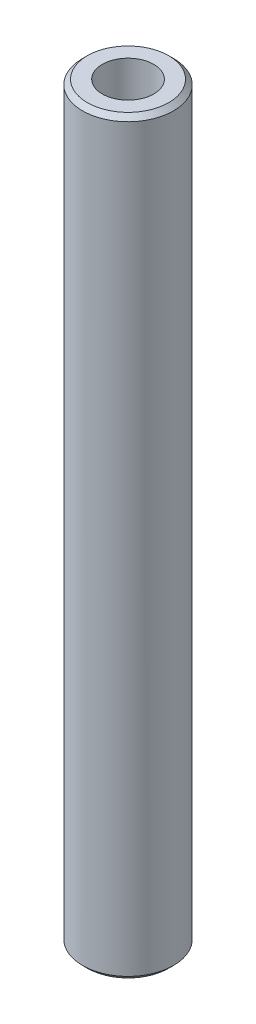
ISO-10303-21;
HEADER;
FILE_DESCRIPTION(('STEP AP214'),'2;1');
FILE_NAME('part.step','',(''),(''),'','','');
FILE_SCHEMA(('AUTOMOTIVE_DESIGN { 1 0 10303 214 1 1 1 1 }'));
ENDSEC;
DATA;
#1=APPLICATION_CONTEXT('core data for automotive mechanical design processes');
#2=APPLICATION_PROTOCOL_DEFINITION('international standard','automotive_design',2000,#1);
#3=PRODUCT_CONTEXT('',#1,'mechanical');
#4=PRODUCT('Part','Part','',(#3));
#5=PRODUCT_RELATED_PRODUCT_CATEGORY('part','',(#4));
#6=PRODUCT_DEFINITION_FORMATION('','',#4);
#7=PRODUCT_DEFINITION_CONTEXT('part definition',#1,'design');
#8=PRODUCT_DEFINITION('design','',#6,#7);
#9=PRODUCT_DEFINITION_SHAPE('','',#8);
#10=(LENGTH_UNIT() NAMED_UNIT(*) SI_UNIT(.MILLI.,.METRE.));
#11=(NAMED_UNIT(*) PLANE_ANGLE_UNIT() SI_UNIT($,.RADIAN.));
#12=(NAMED_UNIT(*) SI_UNIT($,.STERADIAN.) SOLID_ANGLE_UNIT());
#13=UNCERTAINTY_MEASURE_WITH_UNIT(LENGTH_MEASURE(1.E-05),#10,'distance_accuracy_value','');
#14=(GEOMETRIC_REPRESENTATION_CONTEXT(3) GLOBAL_UNCERTAINTY_ASSIGNED_CONTEXT((#13)) GLOBAL_UNIT_ASSIGNED_CONTEXT((#10,
#11,#12)) REPRESENTATION_CONTEXT('',''));
#15=CARTESIAN_POINT('',(0.,0.,0.));
#16=DIRECTION('',(0.,0.,1.));
#17=DIRECTION('',(1.,0.,0.));
#18=AXIS2_PLACEMENT_3D('',#15,#16,#17);
#19=CARTESIAN_POINT('',(0.,494.819400580085,0.));
#20=DIRECTION('',(0.,-1.,0.));
#21=DIRECTION('',(0.,0.,-1.));
#22=AXIS2_PLACEMENT_3D('',#19,#20,#21);
#23=CYLINDRICAL_SURFACE('',#22,30.);
#24=CARTESIAN_POINT('',(0.,491.671943410015,0.));
#25=DIRECTION('',(0.,1.,0.));
#26=DIRECTION('',(0.,0.,1.));
#27=AXIS2_PLACEMENT_3D('',#24,#25,#26);
#28=CIRCLE('',#27,30.);
#29=CARTESIAN_POINT('',(0.,491.671943410015,-30.));
#30=VERTEX_POINT('',#29);
#31=EDGE_CURVE('E50',#30,#30,#28,.F.);
#32=CARTESIAN_POINT('',(0.,3.14745717007053,0.));
#33=DIRECTION('',(0.,1.,0.));
#34=DIRECTION('',(0.,0.,1.));
#35=AXIS2_PLACEMENT_3D('',#32,#33,#34);
#36=CIRCLE('',#35,30.);
#37=CARTESIAN_POINT('',(0.,3.14745717007053,-30.));
#38=VERTEX_POINT('',#37);
#39=EDGE_CURVE('E51',#38,#38,#36,.T.);
#40=CARTESIAN_POINT('',(0.,491.671943410015,-30.));
#41=CARTESIAN_POINT('',(0.,486.583146678349,-30.));
#42=CARTESIAN_POINT('',(0.,481.494349946683,-30.));
#43=CARTESIAN_POINT('',(0.,471.31675648335,-30.));
#44=CARTESIAN_POINT('',(0.,466.227959751684,-30.));
#45=CARTESIAN_POINT('',(0.,456.050366288352,-30.));
#46=CARTESIAN_POINT('',(0.,450.961569556686,-30.));
#47=CARTESIAN_POINT('',(0.,440.783976093354,-30.));
#48=CARTESIAN_POINT('',(0.,435.695179361688,-30.));
#49=CARTESIAN_POINT('',(0.,425.517585898356,-30.));
#50=CARTESIAN_POINT('',(0.,420.42878916669,-30.));
#51=CARTESIAN_POINT('',(0.,410.251195703357,-30.));
#52=CARTESIAN_POINT('',(0.,405.162398971691,-30.));
#53=CARTESIAN_POINT('',(0.,394.984805508359,-30.));
#54=CARTESIAN_POINT('',(0.,389.896008776693,-30.));
#55=CARTESIAN_POINT('',(0.,379.718415313361,-30.));
#56=CARTESIAN_POINT('',(0.,374.629618581695,-30.));
#57=CARTESIAN_POINT('',(0.,364.452025118363,-30.));
#58=CARTESIAN_POINT('',(0.,359.363228386697,-30.));
#59=CARTESIAN_POINT('',(0.,349.185634923364,-30.));
#60=CARTESIAN_POINT('',(0.,344.096838191698,-30.));
#61=CARTESIAN_POINT('',(0.,333.919244728366,-30.));
#62=CARTESIAN_POINT('',(0.,328.8304479967,-30.));
#63=CARTESIAN_POINT('',(0.,318.652854533368,-30.));
#64=CARTESIAN_POINT('',(0.,313.564057801702,-30.));
#65=CARTESIAN_POINT('',(0.,303.38646433837,-30.));
#66=CARTESIAN_POINT('',(0.,298.297667606704,-30.));
#67=CARTESIAN_POINT('',(0.,288.120074143371,-30.));
#68=CARTESIAN_POINT('',(0.,283.031277411705,-30.));
#69=CARTESIAN_POINT('',(0.,272.853683948373,-30.));
#70=CARTESIAN_POINT('',(0.,267.764887216707,-30.));
#71=CARTESIAN_POINT('',(0.,257.587293753375,-30.));
#72=CARTESIAN_POINT('',(0.,252.498497021709,-30.));
#73=CARTESIAN_POINT('',(0.,242.320903558377,-30.));
#74=CARTESIAN_POINT('',(0.,237.23210682671,-30.));
#75=CARTESIAN_POINT('',(0.,227.054513363378,-30.));
#76=CARTESIAN_POINT('',(0.,221.965716631712,-30.));
#77=CARTESIAN_POINT('',(0.,211.78812316838,-30.));
#78=CARTESIAN_POINT('',(0.,206.699326436714,-30.));
#79=CARTESIAN_POINT('',(0.,196.521732973382,-30.));
#80=CARTESIAN_POINT('',(0.,191.432936241716,-30.));
#81=CARTESIAN_POINT('',(0.,181.255342778384,-30.));
#82=CARTESIAN_POINT('',(0.,176.166546046717,-30.));
#83=CARTESIAN_POINT('',(0.,165.988952583385,-30.));
#84=CARTESIAN_POINT('',(0.,160.900155851719,-30.));
#85=CARTESIAN_POINT('',(0.,150.722562388387,-30.));
#86=CARTESIAN_POINT('',(0.,145.633765656721,-30.));
#87=CARTESIAN_POINT('',(0.,135.456172193389,-30.));
#88=CARTESIAN_POINT('',(0.,130.367375461723,-30.));
#89=CARTESIAN_POINT('',(0.,120.189781998391,-30.));
#90=CARTESIAN_POINT('',(0.,115.100985266724,-30.));
#91=CARTESIAN_POINT('',(0.,104.923391803392,-30.));
#92=CARTESIAN_POINT('',(0.,99.8345950717262,-30.));
#93=CARTESIAN_POINT('',(0.,89.657001608394,-30.));
#94=CARTESIAN_POINT('',(0.,84.5682048767279,-30.));
#95=CARTESIAN_POINT('',(0.,74.3906114133957,-30.));
#96=CARTESIAN_POINT('',(0.,69.3018146817297,-30.));
#97=CARTESIAN_POINT('',(0.,59.1242212183975,-30.));
#98=CARTESIAN_POINT('',(0.,54.0354244867314,-30.));
#99=CARTESIAN_POINT('',(0.,43.8578310233992,-30.));
#100=CARTESIAN_POINT('',(0.,38.7690342917331,-30.));
#101=CARTESIAN_POINT('',(0.,28.591440828401,-30.));
#102=CARTESIAN_POINT('',(0.,23.5026440967349,-30.));
#103=CARTESIAN_POINT('',(0.,13.3250506334027,-30.));
#104=CARTESIAN_POINT('',(0.,8.23625390173662,-30.));
#105=CARTESIAN_POINT('',(0.,3.14745717007053,-30.));
#106=B_SPLINE_CURVE_WITH_KNOTS('',3,(#40,#41,#42,#43,#44,#45,#46,#47,#48,#49,#50,#51,#52,#53,
#54,#55,#56,#57,#58,#59,#60,#61,#62,#63,#64,#65,#66,#67,#68,#69,#70,#71,#72,#73,#74,#75,#76,#77,
#78,#79,#80,#81,#82,#83,#84,#85,#86,#87,#88,#89,#90,#91,#92,#93,#94,#95,#96,#97,#98,#99,#100,
#101,#102,#103,#104,#105),.UNSPECIFIED.,.F.,.F.,(4,2,2,2,2,2,2,2,2,2,2,2,2,2,2,2,2,2,2,2,2,2,2,
2,2,2,2,2,2,2,2,2,4),(0.,15.2663901949983,30.5327803899965,45.7991705849948,61.065560779993,
76.3319509749913,91.5983411699895,106.864731364988,122.131121559986,137.397511754984,
152.663901949983,167.930292144981,183.196682339979,198.463072534977,213.729462729976,
228.995852924974,244.262243119972,259.52863331497,274.795023509969,290.061413704967,
305.327803899965,320.594194094963,335.860584289962,351.12697448496,366.393364679958,
381.659754874956,396.926145069955,412.192535264953,427.458925459951,442.725315654949,
457.991705849948,473.258096044946,488.524486239944),.UNSPECIFIED.);
#107=EDGE_CURVE('BSEAM39',#30,#38,#106,.T.);
#108=ORIENTED_EDGE('',*,*,#31,.T.);
#109=ORIENTED_EDGE('',*,*,#39,.T.);
#110=ORIENTED_EDGE('',*,*,#107,.T.);
#111=ORIENTED_EDGE('',*,*,#107,.F.);
#112=EDGE_LOOP('',(#108,#110,#109,#111));
#113=FACE_BOUND('',#112,.T.);
#114=ADVANCED_FACE('F39',(#113),#23,.T.);
#115=CARTESIAN_POINT('',(0.,494.819400580085,0.));
#116=DIRECTION('',(0.,1.,0.));
#117=DIRECTION('',(0.,0.,1.));
#118=AXIS2_PLACEMENT_3D('',#115,#116,#117);
#119=PLANE('',#118);
#120=CARTESIAN_POINT('',(0.,494.819400580085,0.));
#121=DIRECTION('',(0.,1.,0.));
#122=DIRECTION('',(0.,0.,1.));
#123=AXIS2_PLACEMENT_3D('',#120,#121,#122);
#124=CIRCLE('',#123,26.8525428299302);
#125=CARTESIAN_POINT('',(0.,494.819400580085,26.8525428299302));
#126=VERTEX_POINT('',#125);
#127=EDGE_CURVE('E54',#126,#126,#124,.T.);
#128=ORIENTED_EDGE('',*,*,#127,.T.);
#129=EDGE_LOOP('',(#128));
#130=FACE_BOUND('',#129,.T.);
#131=CARTESIAN_POINT('',(0.,494.819400580085,0.));
#132=DIRECTION('',(0.,1.,0.));
#133=DIRECTION('',(0.,0.,1.));
#134=AXIS2_PLACEMENT_3D('',#131,#132,#133);
#135=CIRCLE('',#134,16.9813751937814);
#136=CARTESIAN_POINT('',(0.,494.819400580085,-16.9813751937814));
#137=VERTEX_POINT('',#136);
#138=EDGE_CURVE('E58',#137,#137,#135,.T.);
#139=ORIENTED_EDGE('',*,*,#138,.F.);
#140=EDGE_LOOP('',(#139));
#141=FACE_BOUND('',#140,.T.);
#142=ADVANCED_FACE('F69',(#130,#141),#119,.T.);
#143=CARTESIAN_POINT('',(0.,0.,0.));
#144=DIRECTION('',(0.,1.,0.));
#145=DIRECTION('',(0.,0.,1.));
#146=AXIS2_PLACEMENT_3D('',#143,#144,#145);
#147=PLANE('',#146);
#148=CARTESIAN_POINT('',(0.,0.,0.));
#149=DIRECTION('',(0.,1.,0.));
#150=DIRECTION('',(0.,0.,1.));
#151=AXIS2_PLACEMENT_3D('',#148,#149,#150);
#152=CIRCLE('',#151,26.8525428299294);
#153=CARTESIAN_POINT('',(0.,0.,26.8525428299294));
#154=VERTEX_POINT('',#153);
#155=EDGE_CURVE('E10',#154,#154,#152,.F.);
#156=ORIENTED_EDGE('',*,*,#155,.T.);
#157=EDGE_LOOP('',(#156));
#158=FACE_BOUND('',#157,.T.);
#159=CARTESIAN_POINT('',(0.,0.,0.));
#160=DIRECTION('',(0.,1.,0.));
#161=DIRECTION('',(0.,0.,1.));
#162=AXIS2_PLACEMENT_3D('',#159,#160,#161);
#163=CIRCLE('',#162,16.9813751937814);
#164=CARTESIAN_POINT('',(0.,0.,-16.9813751937814));
#165=VERTEX_POINT('',#164);
#166=EDGE_CURVE('E63',#165,#165,#163,.T.);
#167=ORIENTED_EDGE('',*,*,#166,.T.);
#168=EDGE_LOOP('',(#167));
#169=FACE_BOUND('',#168,.T.);
#170=ADVANCED_FACE('F75',(#158,#169),#147,.F.);
#171=CARTESIAN_POINT('',(0.,494.819400580085,0.));
#172=DIRECTION('',(0.,-1.,0.));
#173=DIRECTION('',(0.,0.,-1.));
#174=AXIS2_PLACEMENT_3D('',#171,#172,#173);
#175=CYLINDRICAL_SURFACE('',#174,16.9813751937814);
#176=CARTESIAN_POINT('',(0.,494.819400580085,-16.9813751937814));
#177=CARTESIAN_POINT('',(0.,489.665031824042,-16.9813751937814));
#178=CARTESIAN_POINT('',(0.,484.510663067999,-16.9813751937814));
#179=CARTESIAN_POINT('',(0.,474.201925555914,-16.9813751937814));
#180=CARTESIAN_POINT('',(0.,469.047556799872,-16.9813751937814));
#181=CARTESIAN_POINT('',(0.,458.738819287787,-16.9813751937814));
#182=CARTESIAN_POINT('',(0.,453.584450531744,-16.9813751937814));
#183=CARTESIAN_POINT('',(0.,443.275713019659,-16.9813751937814));
#184=CARTESIAN_POINT('',(0.,438.121344263616,-16.9813751937814));
#185=CARTESIAN_POINT('',(0.,427.812606751531,-16.9813751937814));
#186=CARTESIAN_POINT('',(0.,422.658237995489,-16.9813751937814));
#187=CARTESIAN_POINT('',(0.,412.349500483404,-16.9813751937814));
#188=CARTESIAN_POINT('',(0.,407.195131727361,-16.9813751937814));
#189=CARTESIAN_POINT('',(0.,396.886394215276,-16.9813751937814));
#190=CARTESIAN_POINT('',(0.,391.732025459234,-16.9813751937814));
#191=CARTESIAN_POINT('',(0.,381.423287947148,-16.9813751937814));
#192=CARTESIAN_POINT('',(0.,376.268919191106,-16.9813751937814));
#193=CARTESIAN_POINT('',(0.,365.960181679021,-16.9813751937814));
#194=CARTESIAN_POINT('',(0.,360.805812922978,-16.9813751937814));
#195=CARTESIAN_POINT('',(0.,350.497075410893,-16.9813751937814));
#196=CARTESIAN_POINT('',(0.,345.342706654851,-16.9813751937814));
#197=CARTESIAN_POINT('',(0.,335.033969142766,-16.9813751937814));
#198=CARTESIAN_POINT('',(0.,329.879600386723,-16.9813751937814));
#199=CARTESIAN_POINT('',(0.,319.570862874638,-16.9813751937814));
#200=CARTESIAN_POINT('',(0.,314.416494118595,-16.9813751937814));
#201=CARTESIAN_POINT('',(0.,304.10775660651,-16.9813751937814));
#202=CARTESIAN_POINT('',(0.,298.953387850468,-16.9813751937814));
#203=CARTESIAN_POINT('',(0.,288.644650338383,-16.9813751937814));
#204=CARTESIAN_POINT('',(0.,283.49028158234,-16.9813751937814));
#205=CARTESIAN_POINT('',(0.,273.181544070255,-16.9813751937814));
#206=CARTESIAN_POINT('',(0.,268.027175314212,-16.9813751937814));
#207=CARTESIAN_POINT('',(0.,257.718437802127,-16.9813751937814));
#208=CARTESIAN_POINT('',(0.,252.564069046085,-16.9813751937814));
#209=CARTESIAN_POINT('',(0.,242.255331534,-16.9813751937814));
#210=CARTESIAN_POINT('',(0.,237.100962777957,-16.9813751937814));
#211=CARTESIAN_POINT('',(0.,226.792225265872,-16.9813751937814));
#212=CARTESIAN_POINT('',(0.,221.63785650983,-16.9813751937814));
#213=CARTESIAN_POINT('',(0.,211.329118997744,-16.9813751937814));
#214=CARTESIAN_POINT('',(0.,206.174750241702,-16.9813751937814));
#215=CARTESIAN_POINT('',(0.,195.866012729617,-16.9813751937814));
#216=CARTESIAN_POINT('',(0.,190.711643973574,-16.9813751937814));
#217=CARTESIAN_POINT('',(0.,180.402906461489,-16.9813751937814));
#218=CARTESIAN_POINT('',(0.,175.248537705447,-16.9813751937814));
#219=CARTESIAN_POINT('',(0.,164.939800193361,-16.9813751937814));
#220=CARTESIAN_POINT('',(0.,159.785431437319,-16.9813751937814));
#221=CARTESIAN_POINT('',(0.,149.476693925234,-16.9813751937814));
#222=CARTESIAN_POINT('',(0.,144.322325169191,-16.9813751937814));
#223=CARTESIAN_POINT('',(0.,134.013587657106,-16.9813751937814));
#224=CARTESIAN_POINT('',(0.,128.859218901064,-16.9813751937814));
#225=CARTESIAN_POINT('',(0.,118.550481388979,-16.9813751937814));
#226=CARTESIAN_POINT('',(0.,113.396112632936,-16.9813751937814));
#227=CARTESIAN_POINT('',(0.,103.087375120851,-16.9813751937814));
#228=CARTESIAN_POINT('',(0.,97.9330063648083,-16.9813751937814));
#229=CARTESIAN_POINT('',(0.,87.6242688527233,-16.9813751937814));
#230=CARTESIAN_POINT('',(0.,82.4699000966807,-16.9813751937814));
#231=CARTESIAN_POINT('',(0.,72.1611625845956,-16.9813751937814));
#232=CARTESIAN_POINT('',(0.,67.0067938285531,-16.9813751937814));
#233=CARTESIAN_POINT('',(0.,56.698056316468,-16.9813751937814));
#234=CARTESIAN_POINT('',(0.,51.5436875604254,-16.9813751937814));
#235=CARTESIAN_POINT('',(0.,41.2349500483403,-16.9813751937814));
#236=CARTESIAN_POINT('',(0.,36.0805812922978,-16.9813751937814));
#237=CARTESIAN_POINT('',(0.,25.7718437802127,-16.9813751937814));
#238=CARTESIAN_POINT('',(0.,20.6174750241701,-16.9813751937814));
#239=CARTESIAN_POINT('',(0.,10.308737512085,-16.9813751937814));
#240=CARTESIAN_POINT('',(0.,5.15436875604249,-16.9813751937814));
#241=CARTESIAN_POINT('',(0.,0.,-16.9813751937814));
#242=B_SPLINE_CURVE_WITH_KNOTS('',3,(#176,#177,#178,#179,#180,#181,#182,#183,#184,#185,#186,
#187,#188,#189,#190,#191,#192,#193,#194,#195,#196,#197,#198,#199,#200,#201,#202,#203,#204,#205,
#206,#207,#208,#209,#210,#211,#212,#213,#214,#215,#216,#217,#218,#219,#220,#221,#222,#223,#224,
#225,#226,#227,#228,#229,#230,#231,#232,#233,#234,#235,#236,#237,#238,#239,#240,#241),
.UNSPECIFIED.,.F.,.F.,(4,2,2,2,2,2,2,2,2,2,2,2,2,2,2,2,2,2,2,2,2,2,2,2,2,2,2,2,2,2,2,2,4),(0.,
15.4631062681276,30.9262125362553,46.3893188043829,61.8524250725105,77.3155313406382,
92.7786376087658,108.241743876893,123.704850145021,139.167956413149,154.631062681276,
170.094168949404,185.557275217532,201.020381485659,216.483487753787,231.946594021915,
247.409700290042,262.87280655817,278.335912826298,293.799019094425,309.262125362553,
324.72523163068,340.188337898808,355.651444166936,371.114550435063,386.577656703191,
402.040762971319,417.503869239446,432.966975507574,448.430081775702,463.893188043829,
479.356294311957,494.819400580085),.UNSPECIFIED.);
#243=EDGE_CURVE('BSEAM70',#137,#165,#242,.T.);
#244=ORIENTED_EDGE('',*,*,#138,.T.);
#245=ORIENTED_EDGE('',*,*,#166,.F.);
#246=ORIENTED_EDGE('',*,*,#243,.T.);
#247=ORIENTED_EDGE('',*,*,#243,.F.);
#248=EDGE_LOOP('',(#244,#246,#245,#247));
#249=FACE_BOUND('',#248,.T.);
#250=ADVANCED_FACE('F70',(#249),#175,.F.);
#251=CARTESIAN_POINT('',(0.,494.819400580085,0.));
#252=DIRECTION('',(0.,-1.,0.));
#253=DIRECTION('',(0.,0.,-1.));
#254=AXIS2_PLACEMENT_3D('',#251,#252,#253);
#255=CONICAL_SURFACE('',#254,26.8525428299302,0.785398163397462);
#256=ORIENTED_EDGE('',*,*,#31,.F.);
#257=EDGE_LOOP('',(#256));
#258=FACE_BOUND('',#257,.T.);
#259=ORIENTED_EDGE('',*,*,#127,.F.);
#260=EDGE_LOOP('',(#259));
#261=FACE_BOUND('',#260,.T.);
#262=ADVANCED_FACE('F81',(#258,#261),#255,.T.);
#263=CARTESIAN_POINT('',(0.,3.14745717007053,0.));
#264=DIRECTION('',(0.,1.,0.));
#265=DIRECTION('',(0.,0.,1.));
#266=AXIS2_PLACEMENT_3D('',#263,#264,#265);
#267=CONICAL_SURFACE('',#266,30.,0.785398163397454);
#268=ORIENTED_EDGE('',*,*,#155,.F.);
#269=EDGE_LOOP('',(#268));
#270=FACE_BOUND('',#269,.T.);
#271=ORIENTED_EDGE('',*,*,#39,.F.);
#272=EDGE_LOOP('',(#271));
#273=FACE_BOUND('',#272,.T.);
#274=ADVANCED_FACE('F45',(#270,#273),#267,.T.);
#275=CLOSED_SHELL('',(#114,#142,#170,#250,#262,#274));
#276=MANIFOLD_SOLID_BREP('B2',#275);
#277=ADVANCED_BREP_SHAPE_REPRESENTATION('',(#18,#276),#14);
#278=SHAPE_DEFINITION_REPRESENTATION(#9,#277);
ENDSEC;
END-ISO-10303-21;
